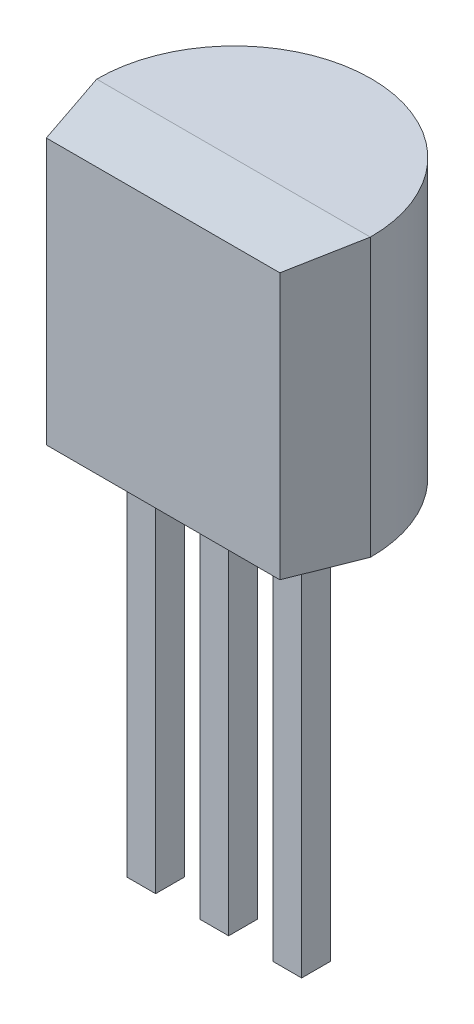
ISO-10303-21;
HEADER;
FILE_DESCRIPTION(('STEP AP214'),'2;1');
FILE_NAME('part.step','',(''),(''),'','','');
FILE_SCHEMA(('AUTOMOTIVE_DESIGN { 1 0 10303 214 1 1 1 1 }'));
ENDSEC;
DATA;
#1=APPLICATION_CONTEXT('core data for automotive mechanical design processes');
#2=APPLICATION_PROTOCOL_DEFINITION('international standard','automotive_design',2000,#1);
#3=PRODUCT_CONTEXT('',#1,'mechanical');
#4=PRODUCT('Part','Part','',(#3));
#5=PRODUCT_RELATED_PRODUCT_CATEGORY('part','',(#4));
#6=PRODUCT_DEFINITION_FORMATION('','',#4);
#7=PRODUCT_DEFINITION_CONTEXT('part definition',#1,'design');
#8=PRODUCT_DEFINITION('design','',#6,#7);
#9=PRODUCT_DEFINITION_SHAPE('','',#8);
#10=(LENGTH_UNIT() NAMED_UNIT(*) SI_UNIT(.MILLI.,.METRE.));
#11=(NAMED_UNIT(*) PLANE_ANGLE_UNIT() SI_UNIT($,.RADIAN.));
#12=(NAMED_UNIT(*) SI_UNIT($,.STERADIAN.) SOLID_ANGLE_UNIT());
#13=UNCERTAINTY_MEASURE_WITH_UNIT(LENGTH_MEASURE(1.E-05),#10,'distance_accuracy_value','');
#14=(GEOMETRIC_REPRESENTATION_CONTEXT(3) GLOBAL_UNCERTAINTY_ASSIGNED_CONTEXT((#13)) GLOBAL_UNIT_ASSIGNED_CONTEXT((#10,
#11,#12)) REPRESENTATION_CONTEXT('',''));
#15=CARTESIAN_POINT('',(0.,0.,0.));
#16=DIRECTION('',(0.,0.,1.));
#17=DIRECTION('',(1.,0.,0.));
#18=AXIS2_PLACEMENT_3D('',#15,#16,#17);
#19=CARTESIAN_POINT('',(2.38,0.,0.014999999999999));
#20=DIRECTION('',(0.,0.996684615822608,-0.081362009454907));
#21=DIRECTION('',(0.,0.081362009454907,0.996684615822608));
#22=AXIS2_PLACEMENT_3D('',#19,#20,#21);
#23=PLANE('',#22);
#24=DIRECTION('',(1.,0.,0.));
#25=VECTOR('',#24,1.);
#26=CARTESIAN_POINT('',(2.03145268219568,0.1,1.24));
#27=LINE('',#26,#25);
#28=CARTESIAN_POINT('',(-2.03145268219568,0.1,1.24));
#29=VERTEX_POINT('',#28);
#30=CARTESIAN_POINT('',(2.03145268219568,0.1,1.24));
#31=VERTEX_POINT('',#30);
#32=EDGE_CURVE('E303',#29,#31,#27,.T.);
#33=ORIENTED_EDGE('',*,*,#32,.F.);
#34=DIRECTION('',(0.272792535710233,0.0782761830138165,0.958883241919249));
#35=VECTOR('',#34,1.);
#36=CARTESIAN_POINT('',(-2.37995273062303,0.,0.015));
#37=LINE('',#36,#35);
#38=CARTESIAN_POINT('',(-2.37995273062303,0.,0.0149999999999997));
#39=VERTEX_POINT('',#38);
#40=EDGE_CURVE('E297',#39,#29,#37,.T.);
#41=ORIENTED_EDGE('',*,*,#40,.F.);
#42=DIRECTION('',(1.,0.,0.));
#43=VECTOR('',#42,1.);
#44=CARTESIAN_POINT('',(2.38,0.,0.015));
#45=LINE('',#44,#43);
#46=CARTESIAN_POINT('',(-1.52,0.,0.0149999999999997));
#47=VERTEX_POINT('',#46);
#48=EDGE_CURVE('E272',#47,#39,#45,.F.);
#49=ORIENTED_EDGE('',*,*,#48,.F.);
#50=CARTESIAN_POINT('',(-1.02,0.,0.0149999999999997));
#51=VERTEX_POINT('',#50);
#52=EDGE_CURVE('E326',#51,#47,#45,.F.);
#53=ORIENTED_EDGE('',*,*,#52,.F.);
#54=CARTESIAN_POINT('',(-0.25,0.,0.0149999999999997));
#55=VERTEX_POINT('',#54);
#56=EDGE_CURVE('E323',#55,#51,#45,.F.);
#57=ORIENTED_EDGE('',*,*,#56,.F.);
#58=CARTESIAN_POINT('',(0.25,0.,0.0149999999999997));
#59=VERTEX_POINT('',#58);
#60=EDGE_CURVE('E321',#59,#55,#45,.F.);
#61=ORIENTED_EDGE('',*,*,#60,.F.);
#62=CARTESIAN_POINT('',(1.02,0.,0.0149999999999994));
#63=VERTEX_POINT('',#62);
#64=EDGE_CURVE('E318',#63,#59,#45,.F.);
#65=ORIENTED_EDGE('',*,*,#64,.F.);
#66=CARTESIAN_POINT('',(1.52,0.,0.0149999999999994));
#67=VERTEX_POINT('',#66);
#68=EDGE_CURVE('E306',#67,#63,#45,.F.);
#69=ORIENTED_EDGE('',*,*,#68,.F.);
#70=CARTESIAN_POINT('',(2.37995273062303,0.,0.0149999999999991));
#71=VERTEX_POINT('',#70);
#72=EDGE_CURVE('E300',#71,#67,#45,.F.);
#73=ORIENTED_EDGE('',*,*,#72,.F.);
#74=DIRECTION('',(0.272792535710231,-0.0782761830138165,-0.958883241919249));
#75=VECTOR('',#74,1.);
#76=CARTESIAN_POINT('',(2.03145268219568,0.1,1.24));
#77=LINE('',#76,#75);
#78=EDGE_CURVE('E299',#31,#71,#77,.T.);
#79=ORIENTED_EDGE('',*,*,#78,.F.);
#80=EDGE_LOOP('',(#33,#41,#49,#53,#57,#61,#65,#69,#73,#79));
#81=FACE_BOUND('',#80,.T.);
#82=ADVANCED_FACE('F37',(#81),#23,.F.);
#83=CARTESIAN_POINT('',(2.03145268219568,0.,1.24));
#84=DIRECTION('',(0.,0.,1.));
#85=DIRECTION('',(1.,0.,0.));
#86=AXIS2_PLACEMENT_3D('',#83,#84,#85);
#87=PLANE('',#86);
#88=DIRECTION('',(1.,0.,0.));
#89=VECTOR('',#88,1.);
#90=CARTESIAN_POINT('',(2.03145268219568,4.725,1.24));
#91=LINE('',#90,#89);
#92=CARTESIAN_POINT('',(2.03145268219568,4.725,1.24));
#93=VERTEX_POINT('',#92);
#94=CARTESIAN_POINT('',(-2.03145268219567,4.725,1.24));
#95=VERTEX_POINT('',#94);
#96=EDGE_CURVE('E350',#93,#95,#91,.F.);
#97=ORIENTED_EDGE('',*,*,#96,.T.);
#98=DIRECTION('',(0.,1.,0.));
#99=VECTOR('',#98,1.);
#100=CARTESIAN_POINT('',(-2.03145268219567,0.,1.24));
#101=LINE('',#100,#99);
#102=EDGE_CURVE('E283',#95,#29,#101,.F.);
#103=ORIENTED_EDGE('',*,*,#102,.T.);
#104=ORIENTED_EDGE('',*,*,#32,.T.);
#105=DIRECTION('',(0.,1.,0.));
#106=VECTOR('',#105,1.);
#107=CARTESIAN_POINT('',(2.03145268219568,0.,1.24));
#108=LINE('',#107,#106);
#109=EDGE_CURVE('E296',#31,#93,#108,.T.);
#110=ORIENTED_EDGE('',*,*,#109,.T.);
#111=EDGE_LOOP('',(#97,#103,#104,#110));
#112=FACE_BOUND('',#111,.T.);
#113=ADVANCED_FACE('F351',(#112),#87,.T.);
#114=CARTESIAN_POINT('',(2.38,4.725,1.24));
#115=DIRECTION('',(0.,-0.996684615822608,-0.081362009454907));
#116=DIRECTION('',(0.,0.081362009454907,-0.996684615822608));
#117=AXIS2_PLACEMENT_3D('',#114,#115,#116);
#118=PLANE('',#117);
#119=DIRECTION('',(1.,0.,0.));
#120=VECTOR('',#119,1.);
#121=CARTESIAN_POINT('',(0.,4.825,0.015));
#122=LINE('',#121,#120);
#123=CARTESIAN_POINT('',(-2.37995273062303,4.825,0.0149999999999998));
#124=VERTEX_POINT('',#123);
#125=CARTESIAN_POINT('',(2.37995273062302,4.825,0.0150000000000094));
#126=VERTEX_POINT('',#125);
#127=EDGE_CURVE('E279',#124,#126,#122,.T.);
#128=ORIENTED_EDGE('',*,*,#127,.F.);
#129=DIRECTION('',(0.272792535710233,-0.0782761830138151,0.958883241919249));
#130=VECTOR('',#129,1.);
#131=CARTESIAN_POINT('',(-2.37995273062303,4.825,0.015));
#132=LINE('',#131,#130);
#133=EDGE_CURVE('E291',#124,#95,#132,.T.);
#134=ORIENTED_EDGE('',*,*,#133,.T.);
#135=ORIENTED_EDGE('',*,*,#96,.F.);
#136=DIRECTION('',(0.272792535710231,0.078276183013815,-0.95888324191925));
#137=VECTOR('',#136,1.);
#138=CARTESIAN_POINT('',(2.03145268219568,4.725,1.24));
#139=LINE('',#138,#137);
#140=EDGE_CURVE('E294',#93,#126,#139,.T.);
#141=ORIENTED_EDGE('',*,*,#140,.T.);
#142=EDGE_LOOP('',(#128,#134,#135,#141));
#143=FACE_BOUND('',#142,.T.);
#144=ADVANCED_FACE('F359',(#143),#118,.F.);
#145=CARTESIAN_POINT('',(2.03145268219568,0.,1.24));
#146=DIRECTION('',(-0.961834426571274,0.,-0.273632117746271));
#147=DIRECTION('',(-0.273632117746271,0.,0.961834426571274));
#148=AXIS2_PLACEMENT_3D('',#145,#146,#147);
#149=PLANE('',#148);
#150=DIRECTION('',(0.,1.,0.));
#151=VECTOR('',#150,1.);
#152=CARTESIAN_POINT('',(2.37995273062303,0.,0.0149999999999989));
#153=LINE('',#152,#151);
#154=EDGE_CURVE('E282',#126,#71,#153,.F.);
#155=ORIENTED_EDGE('',*,*,#154,.F.);
#156=ORIENTED_EDGE('',*,*,#140,.F.);
#157=ORIENTED_EDGE('',*,*,#109,.F.);
#158=ORIENTED_EDGE('',*,*,#78,.T.);
#159=EDGE_LOOP('',(#155,#156,#157,#158));
#160=FACE_BOUND('',#159,.T.);
#161=ADVANCED_FACE('F360',(#160),#149,.F.);
#162=CARTESIAN_POINT('',(0.,0.,-0.175550197655565));
#163=DIRECTION('',(0.,1.,0.));
#164=DIRECTION('',(0.,0.,1.));
#165=AXIS2_PLACEMENT_3D('',#162,#163,#164);
#166=PLANE('',#165);
#167=DIRECTION('',(-1.,0.,0.));
#168=VECTOR('',#167,1.);
#169=CARTESIAN_POINT('',(-1.52,0.,-0.15));
#170=LINE('',#169,#168);
#171=CARTESIAN_POINT('',(-1.02,0.,-0.15));
#172=VERTEX_POINT('',#171);
#173=CARTESIAN_POINT('',(-1.52,0.,-0.15));
#174=VERTEX_POINT('',#173);
#175=EDGE_CURVE('E51',#172,#174,#170,.T.);
#176=ORIENTED_EDGE('',*,*,#175,.T.);
#177=DIRECTION('',(0.,0.,1.));
#178=VECTOR('',#177,1.);
#179=CARTESIAN_POINT('',(-1.52,0.,0.35));
#180=LINE('',#179,#178);
#181=EDGE_CURVE('E199',#174,#47,#180,.T.);
#182=ORIENTED_EDGE('',*,*,#181,.T.);
#183=ORIENTED_EDGE('',*,*,#48,.T.);
#184=CARTESIAN_POINT('',(0.,0.,0.));
#185=DIRECTION('',(0.,1.,0.));
#186=DIRECTION('',(0.,0.,1.));
#187=AXIS2_PLACEMENT_3D('',#184,#185,#186);
#188=CIRCLE('',#187,2.38);
#189=EDGE_CURVE('E288',#71,#39,#188,.T.);
#190=ORIENTED_EDGE('',*,*,#189,.F.);
#191=ORIENTED_EDGE('',*,*,#72,.T.);
#192=DIRECTION('',(0.,0.,-1.));
#193=VECTOR('',#192,1.);
#194=CARTESIAN_POINT('',(1.52,0.,0.349999999999999));
#195=LINE('',#194,#193);
#196=CARTESIAN_POINT('',(1.52,0.,-0.150000000000001));
#197=VERTEX_POINT('',#196);
#198=EDGE_CURVE('E266',#67,#197,#195,.T.);
#199=ORIENTED_EDGE('',*,*,#198,.T.);
#200=DIRECTION('',(-1.,0.,0.));
#201=VECTOR('',#200,1.);
#202=CARTESIAN_POINT('',(1.02,0.,-0.150000000000001));
#203=LINE('',#202,#201);
#204=CARTESIAN_POINT('',(1.02,0.,-0.150000000000001));
#205=VERTEX_POINT('',#204);
#206=EDGE_CURVE('E247',#197,#205,#203,.T.);
#207=ORIENTED_EDGE('',*,*,#206,.T.);
#208=DIRECTION('',(0.,0.,1.));
#209=VECTOR('',#208,1.);
#210=CARTESIAN_POINT('',(1.02,0.,0.349999999999999));
#211=LINE('',#210,#209);
#212=EDGE_CURVE('E257',#205,#63,#211,.T.);
#213=ORIENTED_EDGE('',*,*,#212,.T.);
#214=ORIENTED_EDGE('',*,*,#64,.T.);
#215=DIRECTION('',(0.,0.,-1.));
#216=VECTOR('',#215,1.);
#217=CARTESIAN_POINT('',(0.25,0.,-0.175550197655565));
#218=LINE('',#217,#216);
#219=CARTESIAN_POINT('',(0.25,0.,-0.150000000000001));
#220=VERTEX_POINT('',#219);
#221=EDGE_CURVE('E44',#59,#220,#218,.T.);
#222=ORIENTED_EDGE('',*,*,#221,.T.);
#223=DIRECTION('',(-1.,0.,0.));
#224=VECTOR('',#223,1.);
#225=CARTESIAN_POINT('',(-0.25,0.,-0.150000000000001));
#226=LINE('',#225,#224);
#227=CARTESIAN_POINT('',(-0.25,0.,-0.150000000000001));
#228=VERTEX_POINT('',#227);
#229=EDGE_CURVE('E59',#220,#228,#226,.T.);
#230=ORIENTED_EDGE('',*,*,#229,.T.);
#231=DIRECTION('',(0.,0.,1.));
#232=VECTOR('',#231,1.);
#233=CARTESIAN_POINT('',(-0.25,0.,0.349999999999999));
#234=LINE('',#233,#232);
#235=EDGE_CURVE('E224',#228,#55,#234,.T.);
#236=ORIENTED_EDGE('',*,*,#235,.T.);
#237=ORIENTED_EDGE('',*,*,#56,.T.);
#238=DIRECTION('',(0.,0.,-1.));
#239=VECTOR('',#238,1.);
#240=CARTESIAN_POINT('',(-1.02,0.,-0.175550197655565));
#241=LINE('',#240,#239);
#242=EDGE_CURVE('E11',#51,#172,#241,.T.);
#243=ORIENTED_EDGE('',*,*,#242,.T.);
#244=EDGE_LOOP('',(#176,#182,#183,#190,#191,#199,#207,#213,#214,#222,#230,#236,#237,#243));
#245=FACE_BOUND('',#244,.T.);
#246=ADVANCED_FACE('F331',(#245),#166,.F.);
#247=CARTESIAN_POINT('',(-2.37995273062303,0.,0.015));
#248=DIRECTION('',(0.961834426571273,0.,-0.273632117746272));
#249=DIRECTION('',(-0.273632117746272,0.,-0.961834426571273));
#250=AXIS2_PLACEMENT_3D('',#247,#248,#249);
#251=PLANE('',#250);
#252=ORIENTED_EDGE('',*,*,#102,.F.);
#253=ORIENTED_EDGE('',*,*,#133,.F.);
#254=DIRECTION('',(0.,1.,0.));
#255=VECTOR('',#254,1.);
#256=CARTESIAN_POINT('',(-2.37995273062303,0.,0.0149999999999994));
#257=LINE('',#256,#255);
#258=EDGE_CURVE('E284',#39,#124,#257,.T.);
#259=ORIENTED_EDGE('',*,*,#258,.F.);
#260=ORIENTED_EDGE('',*,*,#40,.T.);
#261=EDGE_LOOP('',(#252,#253,#259,#260));
#262=FACE_BOUND('',#261,.T.);
#263=ADVANCED_FACE('F343',(#262),#251,.F.);
#264=CARTESIAN_POINT('',(0.,4.825,-0.175550197655565));
#265=DIRECTION('',(0.,1.,0.));
#266=DIRECTION('',(0.,0.,1.));
#267=AXIS2_PLACEMENT_3D('',#264,#265,#266);
#268=PLANE('',#267);
#269=ORIENTED_EDGE('',*,*,#127,.T.);
#270=CARTESIAN_POINT('',(0.,4.825,0.));
#271=DIRECTION('',(0.,1.,0.));
#272=DIRECTION('',(0.,0.,1.));
#273=AXIS2_PLACEMENT_3D('',#270,#271,#272);
#274=CIRCLE('',#273,2.38);
#275=EDGE_CURVE('E287',#124,#126,#274,.F.);
#276=ORIENTED_EDGE('',*,*,#275,.F.);
#277=EDGE_LOOP('',(#269,#276));
#278=FACE_BOUND('',#277,.T.);
#279=ADVANCED_FACE('F362',(#278),#268,.T.);
#280=CARTESIAN_POINT('',(0.,0.,0.));
#281=DIRECTION('',(0.,1.,0.));
#282=DIRECTION('',(0.,0.,1.));
#283=AXIS2_PLACEMENT_3D('',#280,#281,#282);
#284=CYLINDRICAL_SURFACE('',#283,2.38);
#285=ORIENTED_EDGE('',*,*,#258,.T.);
#286=ORIENTED_EDGE('',*,*,#275,.T.);
#287=ORIENTED_EDGE('',*,*,#154,.T.);
#288=ORIENTED_EDGE('',*,*,#189,.T.);
#289=EDGE_LOOP('',(#285,#286,#287,#288));
#290=FACE_BOUND('',#289,.T.);
#291=ADVANCED_FACE('F337',(#290),#284,.T.);
#292=CARTESIAN_POINT('',(0.,0.,0.));
#293=DIRECTION('',(0.,-1.,0.));
#294=DIRECTION('',(0.,0.,-1.));
#295=AXIS2_PLACEMENT_3D('',#292,#293,#294);
#296=PLANE('',#295);
#297=CARTESIAN_POINT('',(1.52,0.,0.349999999999999));
#298=VERTEX_POINT('',#297);
#299=EDGE_CURVE('E263',#298,#67,#195,.T.);
#300=ORIENTED_EDGE('',*,*,#299,.T.);
#301=ORIENTED_EDGE('',*,*,#68,.T.);
#302=CARTESIAN_POINT('',(1.02,0.,0.349999999999999));
#303=VERTEX_POINT('',#302);
#304=EDGE_CURVE('E236',#63,#303,#211,.T.);
#305=ORIENTED_EDGE('',*,*,#304,.T.);
#306=DIRECTION('',(1.,0.,0.));
#307=VECTOR('',#306,1.);
#308=CARTESIAN_POINT('',(1.02,0.,0.349999999999999));
#309=LINE('',#308,#307);
#310=EDGE_CURVE('E260',#303,#298,#309,.T.);
#311=ORIENTED_EDGE('',*,*,#310,.T.);
#312=EDGE_LOOP('',(#300,#301,#305,#311));
#313=FACE_BOUND('',#312,.T.);
#314=ADVANCED_FACE('F400',(#313),#296,.F.);
#315=CARTESIAN_POINT('',(1.02,-6.6,0.349999999999999));
#316=DIRECTION('',(-1.,0.,0.));
#317=DIRECTION('',(0.,0.,1.));
#318=AXIS2_PLACEMENT_3D('',#315,#316,#317);
#319=PLANE('',#318);
#320=ORIENTED_EDGE('',*,*,#212,.F.);
#321=DIRECTION('',(0.,1.,0.));
#322=VECTOR('',#321,1.);
#323=CARTESIAN_POINT('',(1.02,-6.6,-0.150000000000001));
#324=LINE('',#323,#322);
#325=CARTESIAN_POINT('',(1.02,-6.6,-0.150000000000001));
#326=VERTEX_POINT('',#325);
#327=EDGE_CURVE('E269',#326,#205,#324,.T.);
#328=ORIENTED_EDGE('',*,*,#327,.F.);
#329=DIRECTION('',(0.,0.,1.));
#330=VECTOR('',#329,1.);
#331=CARTESIAN_POINT('',(1.02,-6.6,0.349999999999999));
#332=LINE('',#331,#330);
#333=CARTESIAN_POINT('',(1.02,-6.6,0.349999999999999));
#334=VERTEX_POINT('',#333);
#335=EDGE_CURVE('E243',#326,#334,#332,.T.);
#336=ORIENTED_EDGE('',*,*,#335,.T.);
#337=DIRECTION('',(0.,1.,0.));
#338=VECTOR('',#337,1.);
#339=CARTESIAN_POINT('',(1.02,-6.6,0.349999999999999));
#340=LINE('',#339,#338);
#341=EDGE_CURVE('E256',#334,#303,#340,.T.);
#342=ORIENTED_EDGE('',*,*,#341,.T.);
#343=ORIENTED_EDGE('',*,*,#304,.F.);
#344=EDGE_LOOP('',(#320,#328,#336,#342,#343));
#345=FACE_BOUND('',#344,.T.);
#346=ADVANCED_FACE('F406',(#345),#319,.T.);
#347=CARTESIAN_POINT('',(1.02,-6.6,-0.150000000000001));
#348=DIRECTION('',(0.,0.,-1.));
#349=DIRECTION('',(-1.,0.,0.));
#350=AXIS2_PLACEMENT_3D('',#347,#348,#349);
#351=PLANE('',#350);
#352=ORIENTED_EDGE('',*,*,#206,.F.);
#353=DIRECTION('',(0.,1.,0.));
#354=VECTOR('',#353,1.);
#355=CARTESIAN_POINT('',(1.52,-6.6,-0.150000000000001));
#356=LINE('',#355,#354);
#357=CARTESIAN_POINT('',(1.52,-6.6,-0.150000000000001));
#358=VERTEX_POINT('',#357);
#359=EDGE_CURVE('E273',#358,#197,#356,.T.);
#360=ORIENTED_EDGE('',*,*,#359,.F.);
#361=DIRECTION('',(-1.,0.,0.));
#362=VECTOR('',#361,1.);
#363=CARTESIAN_POINT('',(1.02,-6.6,-0.150000000000001));
#364=LINE('',#363,#362);
#365=EDGE_CURVE('E253',#358,#326,#364,.T.);
#366=ORIENTED_EDGE('',*,*,#365,.T.);
#367=ORIENTED_EDGE('',*,*,#327,.T.);
#368=EDGE_LOOP('',(#352,#360,#366,#367));
#369=FACE_BOUND('',#368,.T.);
#370=ADVANCED_FACE('F453',(#369),#351,.T.);
#371=CARTESIAN_POINT('',(1.52,-6.6,0.349999999999999));
#372=DIRECTION('',(1.,0.,0.));
#373=DIRECTION('',(0.,0.,-1.));
#374=AXIS2_PLACEMENT_3D('',#371,#372,#373);
#375=PLANE('',#374);
#376=ORIENTED_EDGE('',*,*,#299,.F.);
#377=DIRECTION('',(0.,1.,0.));
#378=VECTOR('',#377,1.);
#379=CARTESIAN_POINT('',(1.52,-6.6,0.349999999999999));
#380=LINE('',#379,#378);
#381=CARTESIAN_POINT('',(1.52,-6.6,0.349999999999999));
#382=VERTEX_POINT('',#381);
#383=EDGE_CURVE('E275',#382,#298,#380,.T.);
#384=ORIENTED_EDGE('',*,*,#383,.F.);
#385=DIRECTION('',(0.,0.,-1.));
#386=VECTOR('',#385,1.);
#387=CARTESIAN_POINT('',(1.52,-6.6,0.349999999999999));
#388=LINE('',#387,#386);
#389=EDGE_CURVE('E250',#382,#358,#388,.T.);
#390=ORIENTED_EDGE('',*,*,#389,.T.);
#391=ORIENTED_EDGE('',*,*,#359,.T.);
#392=ORIENTED_EDGE('',*,*,#198,.F.);
#393=EDGE_LOOP('',(#376,#384,#390,#391,#392));
#394=FACE_BOUND('',#393,.T.);
#395=ADVANCED_FACE('F463',(#394),#375,.T.);
#396=CARTESIAN_POINT('',(1.02,-6.6,0.349999999999999));
#397=DIRECTION('',(0.,0.,1.));
#398=DIRECTION('',(1.,0.,0.));
#399=AXIS2_PLACEMENT_3D('',#396,#397,#398);
#400=PLANE('',#399);
#401=ORIENTED_EDGE('',*,*,#310,.F.);
#402=ORIENTED_EDGE('',*,*,#341,.F.);
#403=DIRECTION('',(1.,0.,0.));
#404=VECTOR('',#403,1.);
#405=CARTESIAN_POINT('',(1.02,-6.6,0.349999999999999));
#406=LINE('',#405,#404);
#407=EDGE_CURVE('E246',#334,#382,#406,.T.);
#408=ORIENTED_EDGE('',*,*,#407,.T.);
#409=ORIENTED_EDGE('',*,*,#383,.T.);
#410=EDGE_LOOP('',(#401,#402,#408,#409));
#411=FACE_BOUND('',#410,.T.);
#412=ADVANCED_FACE('F475',(#411),#400,.T.);
#413=CARTESIAN_POINT('',(0.,-6.6,0.));
#414=DIRECTION('',(0.,-1.,0.));
#415=DIRECTION('',(0.,0.,-1.));
#416=AXIS2_PLACEMENT_3D('',#413,#414,#415);
#417=PLANE('',#416);
#418=ORIENTED_EDGE('',*,*,#335,.F.);
#419=ORIENTED_EDGE('',*,*,#365,.F.);
#420=ORIENTED_EDGE('',*,*,#389,.F.);
#421=ORIENTED_EDGE('',*,*,#407,.F.);
#422=EDGE_LOOP('',(#418,#419,#420,#421));
#423=FACE_BOUND('',#422,.T.);
#424=ADVANCED_FACE('F487',(#423),#417,.T.);
#425=CARTESIAN_POINT('',(0.,0.,0.));
#426=DIRECTION('',(0.,-1.,0.));
#427=DIRECTION('',(0.,0.,-1.));
#428=AXIS2_PLACEMENT_3D('',#425,#426,#427);
#429=PLANE('',#428);
#430=DIRECTION('',(0.,0.,-1.));
#431=VECTOR('',#430,1.);
#432=CARTESIAN_POINT('',(0.25,0.,0.349999999999999));
#433=LINE('',#432,#431);
#434=CARTESIAN_POINT('',(0.25,0.,0.349999999999999));
#435=VERTEX_POINT('',#434);
#436=EDGE_CURVE('E230',#435,#59,#433,.T.);
#437=ORIENTED_EDGE('',*,*,#436,.T.);
#438=ORIENTED_EDGE('',*,*,#60,.T.);
#439=CARTESIAN_POINT('',(-0.25,0.,0.349999999999999));
#440=VERTEX_POINT('',#439);
#441=EDGE_CURVE('E207',#55,#440,#234,.T.);
#442=ORIENTED_EDGE('',*,*,#441,.T.);
#443=DIRECTION('',(1.,0.,0.));
#444=VECTOR('',#443,1.);
#445=CARTESIAN_POINT('',(-0.25,0.,0.349999999999999));
#446=LINE('',#445,#444);
#447=EDGE_CURVE('E227',#440,#435,#446,.T.);
#448=ORIENTED_EDGE('',*,*,#447,.T.);
#449=EDGE_LOOP('',(#437,#438,#442,#448));
#450=FACE_BOUND('',#449,.T.);
#451=ADVANCED_FACE('F372',(#450),#429,.F.);
#452=CARTESIAN_POINT('',(-0.25,-6.6,0.349999999999999));
#453=DIRECTION('',(-1.,0.,0.));
#454=DIRECTION('',(0.,0.,1.));
#455=AXIS2_PLACEMENT_3D('',#452,#453,#454);
#456=PLANE('',#455);
#457=ORIENTED_EDGE('',*,*,#235,.F.);
#458=DIRECTION('',(0.,1.,0.));
#459=VECTOR('',#458,1.);
#460=CARTESIAN_POINT('',(-0.25,-6.6,-0.150000000000001));
#461=LINE('',#460,#459);
#462=CARTESIAN_POINT('',(-0.25,-6.6,-0.150000000000001));
#463=VERTEX_POINT('',#462);
#464=EDGE_CURVE('E234',#463,#228,#461,.T.);
#465=ORIENTED_EDGE('',*,*,#464,.F.);
#466=DIRECTION('',(0.,0.,1.));
#467=VECTOR('',#466,1.);
#468=CARTESIAN_POINT('',(-0.25,-6.6,0.349999999999999));
#469=LINE('',#468,#467);
#470=CARTESIAN_POINT('',(-0.25,-6.6,0.349999999999999));
#471=VERTEX_POINT('',#470);
#472=EDGE_CURVE('E211',#463,#471,#469,.T.);
#473=ORIENTED_EDGE('',*,*,#472,.T.);
#474=DIRECTION('',(0.,1.,0.));
#475=VECTOR('',#474,1.);
#476=CARTESIAN_POINT('',(-0.25,-6.6,0.349999999999999));
#477=LINE('',#476,#475);
#478=EDGE_CURVE('E223',#471,#440,#477,.T.);
#479=ORIENTED_EDGE('',*,*,#478,.T.);
#480=ORIENTED_EDGE('',*,*,#441,.F.);
#481=EDGE_LOOP('',(#457,#465,#473,#479,#480));
#482=FACE_BOUND('',#481,.T.);
#483=ADVANCED_FACE('F380',(#482),#456,.T.);
#484=CARTESIAN_POINT('',(-0.25,-6.6,-0.150000000000001));
#485=DIRECTION('',(0.,0.,-1.));
#486=DIRECTION('',(-1.,0.,0.));
#487=AXIS2_PLACEMENT_3D('',#484,#485,#486);
#488=PLANE('',#487);
#489=ORIENTED_EDGE('',*,*,#229,.F.);
#490=DIRECTION('',(0.,1.,0.));
#491=VECTOR('',#490,1.);
#492=CARTESIAN_POINT('',(0.25,-6.6,-0.150000000000001));
#493=LINE('',#492,#491);
#494=CARTESIAN_POINT('',(0.25,-6.6,-0.150000000000001));
#495=VERTEX_POINT('',#494);
#496=EDGE_CURVE('E237',#495,#220,#493,.T.);
#497=ORIENTED_EDGE('',*,*,#496,.F.);
#498=DIRECTION('',(-1.,0.,0.));
#499=VECTOR('',#498,1.);
#500=CARTESIAN_POINT('',(-0.25,-6.6,-0.150000000000001));
#501=LINE('',#500,#499);
#502=EDGE_CURVE('E220',#495,#463,#501,.T.);
#503=ORIENTED_EDGE('',*,*,#502,.T.);
#504=ORIENTED_EDGE('',*,*,#464,.T.);
#505=EDGE_LOOP('',(#489,#497,#503,#504));
#506=FACE_BOUND('',#505,.T.);
#507=ADVANCED_FACE('F389',(#506),#488,.T.);
#508=CARTESIAN_POINT('',(0.25,-6.6,0.349999999999999));
#509=DIRECTION('',(1.,0.,0.));
#510=DIRECTION('',(0.,0.,-1.));
#511=AXIS2_PLACEMENT_3D('',#508,#509,#510);
#512=PLANE('',#511);
#513=ORIENTED_EDGE('',*,*,#436,.F.);
#514=DIRECTION('',(0.,1.,0.));
#515=VECTOR('',#514,1.);
#516=CARTESIAN_POINT('',(0.25,-6.6,0.349999999999999));
#517=LINE('',#516,#515);
#518=CARTESIAN_POINT('',(0.25,-6.6,0.349999999999999));
#519=VERTEX_POINT('',#518);
#520=EDGE_CURVE('E239',#519,#435,#517,.T.);
#521=ORIENTED_EDGE('',*,*,#520,.F.);
#522=DIRECTION('',(0.,0.,-1.));
#523=VECTOR('',#522,1.);
#524=CARTESIAN_POINT('',(0.25,-6.6,0.349999999999999));
#525=LINE('',#524,#523);
#526=EDGE_CURVE('E217',#519,#495,#525,.T.);
#527=ORIENTED_EDGE('',*,*,#526,.T.);
#528=ORIENTED_EDGE('',*,*,#496,.T.);
#529=ORIENTED_EDGE('',*,*,#221,.F.);
#530=EDGE_LOOP('',(#513,#521,#527,#528,#529));
#531=FACE_BOUND('',#530,.T.);
#532=ADVANCED_FACE('F369',(#531),#512,.T.);
#533=CARTESIAN_POINT('',(-0.25,-6.6,0.349999999999999));
#534=DIRECTION('',(0.,0.,1.));
#535=DIRECTION('',(1.,0.,0.));
#536=AXIS2_PLACEMENT_3D('',#533,#534,#535);
#537=PLANE('',#536);
#538=ORIENTED_EDGE('',*,*,#447,.F.);
#539=ORIENTED_EDGE('',*,*,#478,.F.);
#540=DIRECTION('',(1.,0.,0.));
#541=VECTOR('',#540,1.);
#542=CARTESIAN_POINT('',(-0.25,-6.6,0.349999999999999));
#543=LINE('',#542,#541);
#544=EDGE_CURVE('E214',#471,#519,#543,.T.);
#545=ORIENTED_EDGE('',*,*,#544,.T.);
#546=ORIENTED_EDGE('',*,*,#520,.T.);
#547=EDGE_LOOP('',(#538,#539,#545,#546));
#548=FACE_BOUND('',#547,.T.);
#549=ADVANCED_FACE('F384',(#548),#537,.T.);
#550=CARTESIAN_POINT('',(0.,-6.6,0.));
#551=DIRECTION('',(0.,-1.,0.));
#552=DIRECTION('',(0.,0.,-1.));
#553=AXIS2_PLACEMENT_3D('',#550,#551,#552);
#554=PLANE('',#553);
#555=ORIENTED_EDGE('',*,*,#472,.F.);
#556=ORIENTED_EDGE('',*,*,#502,.F.);
#557=ORIENTED_EDGE('',*,*,#526,.F.);
#558=ORIENTED_EDGE('',*,*,#544,.F.);
#559=EDGE_LOOP('',(#555,#556,#557,#558));
#560=FACE_BOUND('',#559,.T.);
#561=ADVANCED_FACE('F388',(#560),#554,.T.);
#562=CARTESIAN_POINT('',(0.,0.,0.));
#563=DIRECTION('',(0.,-1.,0.));
#564=DIRECTION('',(0.,0.,-1.));
#565=AXIS2_PLACEMENT_3D('',#562,#563,#564);
#566=PLANE('',#565);
#567=DIRECTION('',(0.,0.,-1.));
#568=VECTOR('',#567,1.);
#569=CARTESIAN_POINT('',(-1.02,0.,0.35));
#570=LINE('',#569,#568);
#571=CARTESIAN_POINT('',(-1.02,0.,0.35));
#572=VERTEX_POINT('',#571);
#573=EDGE_CURVE('E194',#572,#51,#570,.T.);
#574=ORIENTED_EDGE('',*,*,#573,.T.);
#575=ORIENTED_EDGE('',*,*,#52,.T.);
#576=CARTESIAN_POINT('',(-1.52,0.,0.35));
#577=VERTEX_POINT('',#576);
#578=EDGE_CURVE('E202',#47,#577,#180,.T.);
#579=ORIENTED_EDGE('',*,*,#578,.T.);
#580=DIRECTION('',(1.,0.,0.));
#581=VECTOR('',#580,1.);
#582=CARTESIAN_POINT('',(-1.52,0.,0.35));
#583=LINE('',#582,#581);
#584=EDGE_CURVE('E173',#577,#572,#583,.T.);
#585=ORIENTED_EDGE('',*,*,#584,.T.);
#586=EDGE_LOOP('',(#574,#575,#579,#585));
#587=FACE_BOUND('',#586,.T.);
#588=ADVANCED_FACE('F544',(#587),#566,.F.);
#589=CARTESIAN_POINT('',(-1.52,-6.6,0.35));
#590=DIRECTION('',(-1.,0.,0.));
#591=DIRECTION('',(0.,0.,1.));
#592=AXIS2_PLACEMENT_3D('',#589,#590,#591);
#593=PLANE('',#592);
#594=ORIENTED_EDGE('',*,*,#181,.F.);
#595=DIRECTION('',(0.,1.,0.));
#596=VECTOR('',#595,1.);
#597=CARTESIAN_POINT('',(-1.52,-6.6,-0.15));
#598=LINE('',#597,#596);
#599=CARTESIAN_POINT('',(-1.52,-6.6,-0.15));
#600=VERTEX_POINT('',#599);
#601=EDGE_CURVE('E192',#600,#174,#598,.T.);
#602=ORIENTED_EDGE('',*,*,#601,.F.);
#603=DIRECTION('',(0.,0.,1.));
#604=VECTOR('',#603,1.);
#605=CARTESIAN_POINT('',(-1.52,-6.6,0.35));
#606=LINE('',#605,#604);
#607=CARTESIAN_POINT('',(-1.52,-6.6,0.35));
#608=VERTEX_POINT('',#607);
#609=EDGE_CURVE('E185',#600,#608,#606,.T.);
#610=ORIENTED_EDGE('',*,*,#609,.T.);
#611=DIRECTION('',(0.,1.,0.));
#612=VECTOR('',#611,1.);
#613=CARTESIAN_POINT('',(-1.52,-6.6,0.35));
#614=LINE('',#613,#612);
#615=EDGE_CURVE('E168',#608,#577,#614,.T.);
#616=ORIENTED_EDGE('',*,*,#615,.T.);
#617=ORIENTED_EDGE('',*,*,#578,.F.);
#618=EDGE_LOOP('',(#594,#602,#610,#616,#617));
#619=FACE_BOUND('',#618,.T.);
#620=ADVANCED_FACE('F191',(#619),#593,.T.);
#621=CARTESIAN_POINT('',(-1.52,-6.6,-0.15));
#622=DIRECTION('',(0.,0.,-1.));
#623=DIRECTION('',(-1.,0.,0.));
#624=AXIS2_PLACEMENT_3D('',#621,#622,#623);
#625=PLANE('',#624);
#626=ORIENTED_EDGE('',*,*,#175,.F.);
#627=DIRECTION('',(0.,1.,0.));
#628=VECTOR('',#627,1.);
#629=CARTESIAN_POINT('',(-1.02,-6.6,-0.15));
#630=LINE('',#629,#628);
#631=CARTESIAN_POINT('',(-1.02,-6.6,-0.15));
#632=VERTEX_POINT('',#631);
#633=EDGE_CURVE('E208',#632,#172,#630,.T.);
#634=ORIENTED_EDGE('',*,*,#633,.F.);
#635=DIRECTION('',(-1.,0.,0.));
#636=VECTOR('',#635,1.);
#637=CARTESIAN_POINT('',(-1.52,-6.6,-0.15));
#638=LINE('',#637,#636);
#639=EDGE_CURVE('E178',#632,#600,#638,.T.);
#640=ORIENTED_EDGE('',*,*,#639,.T.);
#641=ORIENTED_EDGE('',*,*,#601,.T.);
#642=EDGE_LOOP('',(#626,#634,#640,#641));
#643=FACE_BOUND('',#642,.T.);
#644=ADVANCED_FACE('F564',(#643),#625,.T.);
#645=CARTESIAN_POINT('',(-1.02,-6.6,0.35));
#646=DIRECTION('',(1.,0.,0.));
#647=DIRECTION('',(0.,0.,-1.));
#648=AXIS2_PLACEMENT_3D('',#645,#646,#647);
#649=PLANE('',#648);
#650=ORIENTED_EDGE('',*,*,#573,.F.);
#651=DIRECTION('',(0.,1.,0.));
#652=VECTOR('',#651,1.);
#653=CARTESIAN_POINT('',(-1.02,-6.6,0.35));
#654=LINE('',#653,#652);
#655=CARTESIAN_POINT('',(-1.02,-6.6,0.35));
#656=VERTEX_POINT('',#655);
#657=EDGE_CURVE('E177',#656,#572,#654,.T.);
#658=ORIENTED_EDGE('',*,*,#657,.F.);
#659=DIRECTION('',(0.,0.,-1.));
#660=VECTOR('',#659,1.);
#661=CARTESIAN_POINT('',(-1.02,-6.6,0.35));
#662=LINE('',#661,#660);
#663=EDGE_CURVE('E188',#656,#632,#662,.T.);
#664=ORIENTED_EDGE('',*,*,#663,.T.);
#665=ORIENTED_EDGE('',*,*,#633,.T.);
#666=ORIENTED_EDGE('',*,*,#242,.F.);
#667=EDGE_LOOP('',(#650,#658,#664,#665,#666));
#668=FACE_BOUND('',#667,.T.);
#669=ADVANCED_FACE('F573',(#668),#649,.T.);
#670=CARTESIAN_POINT('',(-1.52,-6.6,0.35));
#671=DIRECTION('',(0.,0.,1.));
#672=DIRECTION('',(1.,0.,0.));
#673=AXIS2_PLACEMENT_3D('',#670,#671,#672);
#674=PLANE('',#673);
#675=ORIENTED_EDGE('',*,*,#584,.F.);
#676=ORIENTED_EDGE('',*,*,#615,.F.);
#677=DIRECTION('',(1.,0.,0.));
#678=VECTOR('',#677,1.);
#679=CARTESIAN_POINT('',(-1.52,-6.6,0.35));
#680=LINE('',#679,#678);
#681=EDGE_CURVE('E171',#608,#656,#680,.T.);
#682=ORIENTED_EDGE('',*,*,#681,.T.);
#683=ORIENTED_EDGE('',*,*,#657,.T.);
#684=EDGE_LOOP('',(#675,#676,#682,#683));
#685=FACE_BOUND('',#684,.T.);
#686=ADVANCED_FACE('F170',(#685),#674,.T.);
#687=CARTESIAN_POINT('',(0.,-6.6,0.));
#688=DIRECTION('',(0.,-1.,0.));
#689=DIRECTION('',(0.,0.,-1.));
#690=AXIS2_PLACEMENT_3D('',#687,#688,#689);
#691=PLANE('',#690);
#692=ORIENTED_EDGE('',*,*,#609,.F.);
#693=ORIENTED_EDGE('',*,*,#639,.F.);
#694=ORIENTED_EDGE('',*,*,#663,.F.);
#695=ORIENTED_EDGE('',*,*,#681,.F.);
#696=EDGE_LOOP('',(#692,#693,#694,#695));
#697=FACE_BOUND('',#696,.T.);
#698=ADVANCED_FACE('F183',(#697),#691,.T.);
#699=CLOSED_SHELL('',(#82,#113,#144,#161,#246,#263,#279,#291,#314,#346,#370,#395,#412,#424,#451,
#483,#507,#532,#549,#561,#588,#620,#644,#669,#686,#698));
#700=MANIFOLD_SOLID_BREP('B2',#699);
#701=ADVANCED_BREP_SHAPE_REPRESENTATION('',(#18,#700),#14);
#702=SHAPE_DEFINITION_REPRESENTATION(#9,#701);
ENDSEC;
END-ISO-10303-21;
